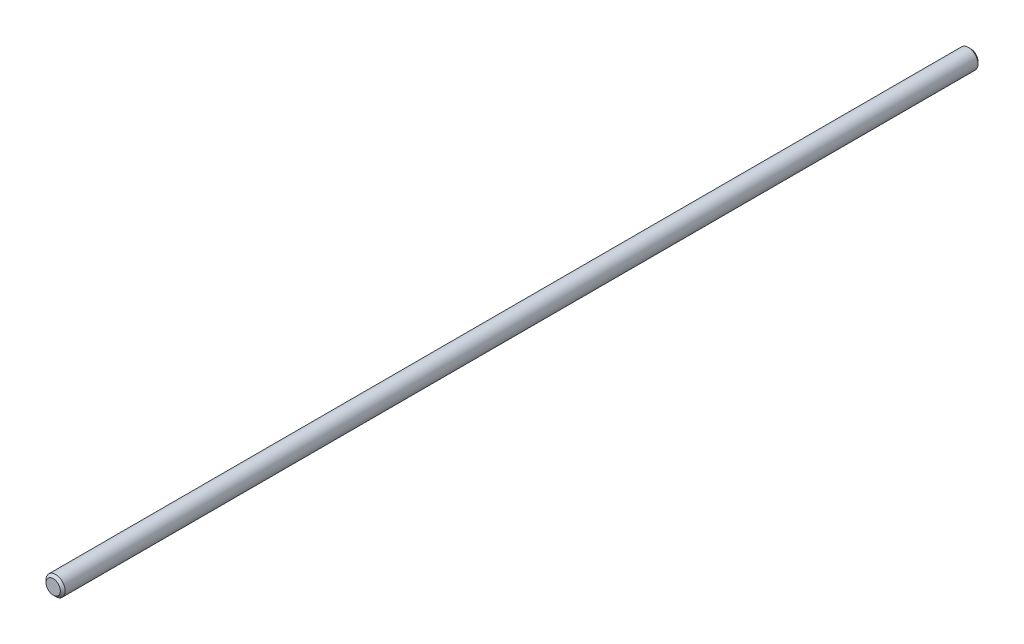
ISO-10303-21;
HEADER;
FILE_DESCRIPTION(('STEP AP214'),'2;1');
FILE_NAME('part.step','',(''),(''),'','','');
FILE_SCHEMA(('AUTOMOTIVE_DESIGN { 1 0 10303 214 1 1 1 1 }'));
ENDSEC;
DATA;
#1=APPLICATION_CONTEXT('core data for automotive mechanical design processes');
#2=APPLICATION_PROTOCOL_DEFINITION('international standard','automotive_design',2000,#1);
#3=PRODUCT_CONTEXT('',#1,'mechanical');
#4=PRODUCT('Part','Part','',(#3));
#5=PRODUCT_RELATED_PRODUCT_CATEGORY('part','',(#4));
#6=PRODUCT_DEFINITION_FORMATION('','',#4);
#7=PRODUCT_DEFINITION_CONTEXT('part definition',#1,'design');
#8=PRODUCT_DEFINITION('design','',#6,#7);
#9=PRODUCT_DEFINITION_SHAPE('','',#8);
#10=(LENGTH_UNIT() NAMED_UNIT(*) SI_UNIT(.MILLI.,.METRE.));
#11=(NAMED_UNIT(*) PLANE_ANGLE_UNIT() SI_UNIT($,.RADIAN.));
#12=(NAMED_UNIT(*) SI_UNIT($,.STERADIAN.) SOLID_ANGLE_UNIT());
#13=UNCERTAINTY_MEASURE_WITH_UNIT(LENGTH_MEASURE(1.E-05),#10,'distance_accuracy_value','');
#14=(GEOMETRIC_REPRESENTATION_CONTEXT(3) GLOBAL_UNCERTAINTY_ASSIGNED_CONTEXT((#13)) GLOBAL_UNIT_ASSIGNED_CONTEXT((#10,
#11,#12)) REPRESENTATION_CONTEXT('',''));
#15=CARTESIAN_POINT('',(0.,0.,0.));
#16=DIRECTION('',(0.,0.,1.));
#17=DIRECTION('',(1.,0.,0.));
#18=AXIS2_PLACEMENT_3D('',#15,#16,#17);
#19=CARTESIAN_POINT('',(0.,0.,380.));
#20=DIRECTION('',(0.,0.,-1.));
#21=DIRECTION('',(-1.,0.,0.));
#22=AXIS2_PLACEMENT_3D('',#19,#20,#21);
#23=CYLINDRICAL_SURFACE('',#22,3.96875);
#24=CARTESIAN_POINT('',(0.,0.,379.));
#25=DIRECTION('',(0.,0.,1.));
#26=DIRECTION('',(1.,0.,0.));
#27=AXIS2_PLACEMENT_3D('',#24,#25,#26);
#28=CIRCLE('',#27,3.96875);
#29=CARTESIAN_POINT('',(3.96875,0.,379.));
#30=VERTEX_POINT('',#29);
#31=EDGE_CURVE('E10',#30,#30,#28,.F.);
#32=ORIENTED_EDGE('',*,*,#31,.T.);
#33=EDGE_LOOP('',(#32));
#34=FACE_BOUND('',#33,.T.);
#35=CARTESIAN_POINT('',(0.,0.,1.));
#36=DIRECTION('',(0.,0.,1.));
#37=DIRECTION('',(1.,0.,0.));
#38=AXIS2_PLACEMENT_3D('',#35,#36,#37);
#39=CIRCLE('',#38,3.96875);
#40=CARTESIAN_POINT('',(3.96875,0.,1.));
#41=VERTEX_POINT('',#40);
#42=EDGE_CURVE('E46',#41,#41,#39,.T.);
#43=ORIENTED_EDGE('',*,*,#42,.T.);
#44=EDGE_LOOP('',(#43));
#45=FACE_BOUND('',#44,.T.);
#46=ADVANCED_FACE('F31',(#34,#45),#23,.T.);
#47=CARTESIAN_POINT('',(0.,0.,380.));
#48=DIRECTION('',(0.,0.,1.));
#49=DIRECTION('',(1.,0.,0.));
#50=AXIS2_PLACEMENT_3D('',#47,#48,#49);
#51=PLANE('',#50);
#52=CARTESIAN_POINT('',(0.,0.,380.));
#53=DIRECTION('',(0.,0.,1.));
#54=DIRECTION('',(1.,0.,0.));
#55=AXIS2_PLACEMENT_3D('',#52,#53,#54);
#56=CIRCLE('',#55,2.96875000000002);
#57=CARTESIAN_POINT('',(2.96875000000002,0.,380.));
#58=VERTEX_POINT('',#57);
#59=EDGE_CURVE('E38',#58,#58,#56,.T.);
#60=ORIENTED_EDGE('',*,*,#59,.T.);
#61=EDGE_LOOP('',(#60));
#62=FACE_BOUND('',#61,.T.);
#63=ADVANCED_FACE('F62',(#62),#51,.T.);
#64=CARTESIAN_POINT('',(0.,0.,0.));
#65=DIRECTION('',(0.,0.,1.));
#66=DIRECTION('',(1.,0.,0.));
#67=AXIS2_PLACEMENT_3D('',#64,#65,#66);
#68=PLANE('',#67);
#69=CARTESIAN_POINT('',(0.,0.,0.));
#70=DIRECTION('',(0.,0.,1.));
#71=DIRECTION('',(1.,0.,0.));
#72=AXIS2_PLACEMENT_3D('',#69,#70,#71);
#73=CIRCLE('',#72,2.96875000000002);
#74=CARTESIAN_POINT('',(2.96875000000002,0.,0.));
#75=VERTEX_POINT('',#74);
#76=EDGE_CURVE('E42',#75,#75,#73,.F.);
#77=ORIENTED_EDGE('',*,*,#76,.T.);
#78=EDGE_LOOP('',(#77));
#79=FACE_BOUND('',#78,.T.);
#80=ADVANCED_FACE('F55',(#79),#68,.F.);
#81=CARTESIAN_POINT('',(0.,0.,1.));
#82=DIRECTION('',(0.,0.,1.));
#83=DIRECTION('',(1.,0.,0.));
#84=AXIS2_PLACEMENT_3D('',#81,#82,#83);
#85=CONICAL_SURFACE('',#84,3.96875,0.785398163397438);
#86=ORIENTED_EDGE('',*,*,#76,.F.);
#87=EDGE_LOOP('',(#86));
#88=FACE_BOUND('',#87,.T.);
#89=ORIENTED_EDGE('',*,*,#42,.F.);
#90=EDGE_LOOP('',(#89));
#91=FACE_BOUND('',#90,.T.);
#92=ADVANCED_FACE('F53',(#88,#91),#85,.T.);
#93=CARTESIAN_POINT('',(0.,0.,380.));
#94=DIRECTION('',(0.,0.,-1.));
#95=DIRECTION('',(-1.,0.,0.));
#96=AXIS2_PLACEMENT_3D('',#93,#94,#95);
#97=CONICAL_SURFACE('',#96,2.96875000000002,0.785398163397411);
#98=ORIENTED_EDGE('',*,*,#31,.F.);
#99=EDGE_LOOP('',(#98));
#100=FACE_BOUND('',#99,.T.);
#101=ORIENTED_EDGE('',*,*,#59,.F.);
#102=EDGE_LOOP('',(#101));
#103=FACE_BOUND('',#102,.T.);
#104=ADVANCED_FACE('F33',(#100,#103),#97,.T.);
#105=CLOSED_SHELL('',(#46,#63,#80,#92,#104));
#106=MANIFOLD_SOLID_BREP('B2',#105);
#107=ADVANCED_BREP_SHAPE_REPRESENTATION('',(#18,#106),#14);
#108=SHAPE_DEFINITION_REPRESENTATION(#9,#107);
ENDSEC;
END-ISO-10303-21;
